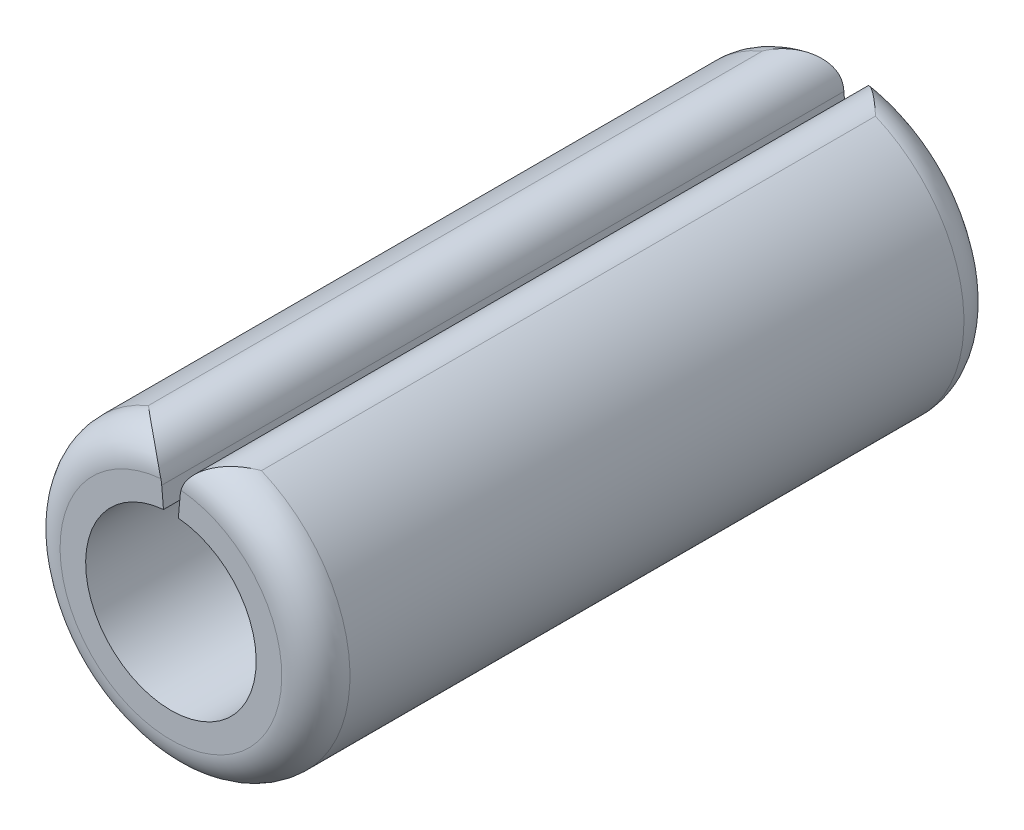
ISO-10303-21;
HEADER;
FILE_DESCRIPTION(('STEP AP214'),'2;1');
FILE_NAME('part.step','',(''),(''),'','','');
FILE_SCHEMA(('AUTOMOTIVE_DESIGN { 1 0 10303 214 1 1 1 1 }'));
ENDSEC;
DATA;
#1=APPLICATION_CONTEXT('core data for automotive mechanical design processes');
#2=APPLICATION_PROTOCOL_DEFINITION('international standard','automotive_design',2000,#1);
#3=PRODUCT_CONTEXT('',#1,'mechanical');
#4=PRODUCT('Part','Part','',(#3));
#5=PRODUCT_RELATED_PRODUCT_CATEGORY('part','',(#4));
#6=PRODUCT_DEFINITION_FORMATION('','',#4);
#7=PRODUCT_DEFINITION_CONTEXT('part definition',#1,'design');
#8=PRODUCT_DEFINITION('design','',#6,#7);
#9=PRODUCT_DEFINITION_SHAPE('','',#8);
#10=(LENGTH_UNIT() NAMED_UNIT(*) SI_UNIT(.MILLI.,.METRE.));
#11=(NAMED_UNIT(*) PLANE_ANGLE_UNIT() SI_UNIT($,.RADIAN.));
#12=(NAMED_UNIT(*) SI_UNIT($,.STERADIAN.) SOLID_ANGLE_UNIT());
#13=UNCERTAINTY_MEASURE_WITH_UNIT(LENGTH_MEASURE(1.E-05),#10,'distance_accuracy_value','');
#14=(GEOMETRIC_REPRESENTATION_CONTEXT(3) GLOBAL_UNCERTAINTY_ASSIGNED_CONTEXT((#13)) GLOBAL_UNIT_ASSIGNED_CONTEXT((#10,
#11,#12)) REPRESENTATION_CONTEXT('',''));
#15=CARTESIAN_POINT('',(0.,0.,0.));
#16=DIRECTION('',(0.,0.,1.));
#17=DIRECTION('',(1.,0.,0.));
#18=AXIS2_PLACEMENT_3D('',#15,#16,#17);
#19=CARTESIAN_POINT('',(0.,0.,-2.));
#20=DIRECTION('',(0.,0.,1.));
#21=DIRECTION('',(1.,0.,0.));
#22=AXIS2_PLACEMENT_3D('',#19,#20,#21);
#23=CYLINDRICAL_SURFACE('',#22,0.85);
#24=CARTESIAN_POINT('',(0.,0.,-1.8));
#25=DIRECTION('',(0.,0.,1.));
#26=DIRECTION('',(1.,0.,0.));
#27=AXIS2_PLACEMENT_3D('',#24,#25,#26);
#28=CIRCLE('',#27,0.85);
#29=CARTESIAN_POINT('',(-0.33103157101867,0.782890860202692,-1.8));
#30=VERTEX_POINT('',#29);
#31=CARTESIAN_POINT('',(0.33103157101867,0.782890860202692,-1.8));
#32=VERTEX_POINT('',#31);
#33=EDGE_CURVE('E141',#30,#32,#28,.T.);
#34=ORIENTED_EDGE('',*,*,#33,.T.);
#35=DIRECTION('',(0.,0.,1.));
#36=VECTOR('',#35,1.);
#37=CARTESIAN_POINT('',(0.33103157101867,0.782890860202692,-2.));
#38=LINE('',#37,#36);
#39=CARTESIAN_POINT('',(0.33103157101867,0.782890860202692,1.8));
#40=VERTEX_POINT('',#39);
#41=EDGE_CURVE('E146',#32,#40,#38,.T.);
#42=ORIENTED_EDGE('',*,*,#41,.T.);
#43=CARTESIAN_POINT('',(0.,0.,1.8));
#44=DIRECTION('',(0.,0.,1.));
#45=DIRECTION('',(1.,0.,0.));
#46=AXIS2_PLACEMENT_3D('',#43,#44,#45);
#47=CIRCLE('',#46,0.85);
#48=CARTESIAN_POINT('',(-0.33103157101867,0.782890860202692,1.8));
#49=VERTEX_POINT('',#48);
#50=EDGE_CURVE('E143',#40,#49,#47,.F.);
#51=ORIENTED_EDGE('',*,*,#50,.T.);
#52=DIRECTION('',(0.,0.,1.));
#53=VECTOR('',#52,1.);
#54=CARTESIAN_POINT('',(-0.33103157101867,0.782890860202692,-2.));
#55=LINE('',#54,#53);
#56=EDGE_CURVE('E139',#49,#30,#55,.F.);
#57=ORIENTED_EDGE('',*,*,#56,.T.);
#58=EDGE_LOOP('',(#34,#42,#51,#57));
#59=FACE_BOUND('',#58,.T.);
#60=ADVANCED_FACE('F31',(#59),#23,.T.);
#61=CARTESIAN_POINT('',(-0.0435778713738293,0.498097349045873,-2.));
#62=DIRECTION('',(0.996194698091746,0.0871557427476585,0.));
#63=DIRECTION('',(-0.0871557427476585,0.996194698091746,0.));
#64=AXIS2_PLACEMENT_3D('',#61,#62,#63);
#65=PLANE('',#64);
#66=DIRECTION('',(-0.0871557427476584,0.996194698091745,0.));
#67=VECTOR('',#66,1.);
#68=CARTESIAN_POINT('',(-0.0435778713738293,0.498097349045873,-2.));
#69=LINE('',#68,#67);
#70=CARTESIAN_POINT('',(-0.0435778713738293,0.498097349045873,-2.));
#71=VERTEX_POINT('',#70);
#72=CARTESIAN_POINT('',(-0.0539028499841634,0.616112394586884,-2.));
#73=VERTEX_POINT('',#72);
#74=EDGE_CURVE('E121',#71,#73,#69,.T.);
#75=ORIENTED_EDGE('',*,*,#74,.T.);
#76=DIRECTION('',(0.,0.,1.));
#77=VECTOR('',#76,1.);
#78=CARTESIAN_POINT('',(-0.0539028499841634,0.616112394586884,-2.));
#79=LINE('',#78,#77);
#80=CARTESIAN_POINT('',(-0.0539028499841634,0.616112394586884,2.));
#81=VERTEX_POINT('',#80);
#82=EDGE_CURVE('E11',#73,#81,#79,.T.);
#83=ORIENTED_EDGE('',*,*,#82,.T.);
#84=DIRECTION('',(-0.0871557427476584,0.996194698091745,0.));
#85=VECTOR('',#84,1.);
#86=CARTESIAN_POINT('',(-0.0435778713738293,0.498097349045873,2.));
#87=LINE('',#86,#85);
#88=CARTESIAN_POINT('',(-0.0435778713738293,0.498097349045873,2.));
#89=VERTEX_POINT('',#88);
#90=EDGE_CURVE('E124',#89,#81,#87,.T.);
#91=ORIENTED_EDGE('',*,*,#90,.F.);
#92=DIRECTION('',(0.,0.,1.));
#93=VECTOR('',#92,1.);
#94=CARTESIAN_POINT('',(-0.0435778713738293,0.498097349045873,-2.));
#95=LINE('',#94,#93);
#96=EDGE_CURVE('E120',#71,#89,#95,.T.);
#97=ORIENTED_EDGE('',*,*,#96,.F.);
#98=EDGE_LOOP('',(#75,#83,#91,#97));
#99=FACE_BOUND('',#98,.T.);
#100=ADVANCED_FACE('F185',(#99),#65,.T.);
#101=CARTESIAN_POINT('',(0.,0.,-2.));
#102=DIRECTION('',(0.,0.,1.));
#103=DIRECTION('',(1.,0.,0.));
#104=AXIS2_PLACEMENT_3D('',#101,#102,#103);
#105=CYLINDRICAL_SURFACE('',#104,0.5);
#106=ORIENTED_EDGE('',*,*,#96,.T.);
#107=CARTESIAN_POINT('',(0.,0.,2.));
#108=DIRECTION('',(0.,0.,-1.));
#109=DIRECTION('',(1.,0.,0.));
#110=AXIS2_PLACEMENT_3D('',#107,#108,#109);
#111=CIRCLE('',#110,0.5);
#112=CARTESIAN_POINT('',(0.0435778713738293,0.498097349045873,2.));
#113=VERTEX_POINT('',#112);
#114=EDGE_CURVE('E106',#113,#89,#111,.T.);
#115=ORIENTED_EDGE('',*,*,#114,.F.);
#116=DIRECTION('',(0.,0.,1.));
#117=VECTOR('',#116,1.);
#118=CARTESIAN_POINT('',(0.0435778713738293,0.498097349045873,-2.));
#119=LINE('',#118,#117);
#120=CARTESIAN_POINT('',(0.0435778713738293,0.498097349045873,-2.));
#121=VERTEX_POINT('',#120);
#122=EDGE_CURVE('E114',#121,#113,#119,.T.);
#123=ORIENTED_EDGE('',*,*,#122,.F.);
#124=CARTESIAN_POINT('',(0.,0.,-2.));
#125=DIRECTION('',(0.,0.,-1.));
#126=DIRECTION('',(1.,0.,0.));
#127=AXIS2_PLACEMENT_3D('',#124,#125,#126);
#128=CIRCLE('',#127,0.5);
#129=EDGE_CURVE('E129',#121,#71,#128,.T.);
#130=ORIENTED_EDGE('',*,*,#129,.T.);
#131=EDGE_LOOP('',(#106,#115,#123,#130));
#132=FACE_BOUND('',#131,.T.);
#133=ADVANCED_FACE('F123',(#132),#105,.F.);
#134=CARTESIAN_POINT('',(0.0740823813355097,0.846765493377984,-2.));
#135=DIRECTION('',(-0.996194698091746,0.0871557427476585,0.));
#136=DIRECTION('',(-0.0871557427476585,-0.996194698091746,0.));
#137=AXIS2_PLACEMENT_3D('',#134,#135,#136);
#138=PLANE('',#137);
#139=DIRECTION('',(-0.0871557427476584,-0.996194698091745,0.));
#140=VECTOR('',#139,1.);
#141=CARTESIAN_POINT('',(0.0740823813355097,0.846765493377984,2.));
#142=LINE('',#141,#140);
#143=CARTESIAN_POINT('',(0.0539028499841634,0.616112394586884,2.));
#144=VERTEX_POINT('',#143);
#145=EDGE_CURVE('E100',#144,#113,#142,.T.);
#146=ORIENTED_EDGE('',*,*,#145,.F.);
#147=DIRECTION('',(0.,0.,1.));
#148=VECTOR('',#147,1.);
#149=CARTESIAN_POINT('',(0.0539028499841634,0.616112394586884,-2.));
#150=LINE('',#149,#148);
#151=CARTESIAN_POINT('',(0.0539028499841595,0.61611239458684,-2.));
#152=VERTEX_POINT('',#151);
#153=EDGE_CURVE('E44',#144,#152,#150,.F.);
#154=ORIENTED_EDGE('',*,*,#153,.T.);
#155=DIRECTION('',(-0.0871557427476584,-0.996194698091745,0.));
#156=VECTOR('',#155,1.);
#157=CARTESIAN_POINT('',(0.0740823813355097,0.846765493377984,-2.));
#158=LINE('',#157,#156);
#159=EDGE_CURVE('E116',#152,#121,#158,.T.);
#160=ORIENTED_EDGE('',*,*,#159,.T.);
#161=ORIENTED_EDGE('',*,*,#122,.T.);
#162=EDGE_LOOP('',(#146,#154,#160,#161));
#163=FACE_BOUND('',#162,.T.);
#164=ADVANCED_FACE('F115',(#163),#138,.T.);
#165=CARTESIAN_POINT('',(0.,0.,-2.));
#166=DIRECTION('',(0.,0.,1.));
#167=DIRECTION('',(1.,0.,0.));
#168=AXIS2_PLACEMENT_3D('',#165,#166,#167);
#169=PLANE('',#168);
#170=ORIENTED_EDGE('',*,*,#159,.F.);
#171=CARTESIAN_POINT('',(0.253141789602513,0.598681246037353,-2.));
#172=DIRECTION('',(0.,0.,1.));
#173=DIRECTION('',(1.,0.,0.));
#174=AXIS2_PLACEMENT_3D('',#171,#172,#173);
#175=CIRCLE('',#174,0.2);
#176=CARTESIAN_POINT('',(0.0591421818509471,0.647303794462777,-2.));
#177=VERTEX_POINT('',#176);
#178=EDGE_CURVE('E52',#152,#177,#175,.F.);
#179=ORIENTED_EDGE('',*,*,#178,.T.);
#180=CARTESIAN_POINT('',(0.,0.,-2.));
#181=DIRECTION('',(0.,0.,1.));
#182=DIRECTION('',(1.,0.,0.));
#183=AXIS2_PLACEMENT_3D('',#180,#181,#182);
#184=CIRCLE('',#183,0.65);
#185=CARTESIAN_POINT('',(-0.0591421818509566,0.64730379446288,-2.));
#186=VERTEX_POINT('',#185);
#187=EDGE_CURVE('E56',#177,#186,#184,.F.);
#188=ORIENTED_EDGE('',*,*,#187,.T.);
#189=CARTESIAN_POINT('',(-0.253141789602513,0.598681246037353,-2.));
#190=DIRECTION('',(0.,0.,1.));
#191=DIRECTION('',(1.,0.,0.));
#192=AXIS2_PLACEMENT_3D('',#189,#190,#191);
#193=CIRCLE('',#192,0.2);
#194=EDGE_CURVE('E148',#186,#73,#193,.F.);
#195=ORIENTED_EDGE('',*,*,#194,.T.);
#196=ORIENTED_EDGE('',*,*,#74,.F.);
#197=ORIENTED_EDGE('',*,*,#129,.F.);
#198=EDGE_LOOP('',(#170,#179,#188,#195,#196,#197));
#199=FACE_BOUND('',#198,.T.);
#200=ADVANCED_FACE('F195',(#199),#169,.F.);
#201=CARTESIAN_POINT('',(0.,0.,2.));
#202=DIRECTION('',(0.,0.,1.));
#203=DIRECTION('',(1.,0.,0.));
#204=AXIS2_PLACEMENT_3D('',#201,#202,#203);
#205=PLANE('',#204);
#206=CARTESIAN_POINT('',(0.,0.,2.));
#207=DIRECTION('',(0.,0.,1.));
#208=DIRECTION('',(1.,0.,0.));
#209=AXIS2_PLACEMENT_3D('',#206,#207,#208);
#210=CIRCLE('',#209,0.65);
#211=CARTESIAN_POINT('',(-0.0591421818509565,0.64730379446288,2.));
#212=VERTEX_POINT('',#211);
#213=CARTESIAN_POINT('',(0.0591421818509471,0.647303794462777,2.));
#214=VERTEX_POINT('',#213);
#215=EDGE_CURVE('E136',#212,#214,#210,.T.);
#216=ORIENTED_EDGE('',*,*,#215,.T.);
#217=CARTESIAN_POINT('',(0.253141789602513,0.598681246037353,2.));
#218=DIRECTION('',(0.,0.,1.));
#219=DIRECTION('',(1.,0.,0.));
#220=AXIS2_PLACEMENT_3D('',#217,#218,#219);
#221=CIRCLE('',#220,0.2);
#222=EDGE_CURVE('E109',#214,#144,#221,.T.);
#223=ORIENTED_EDGE('',*,*,#222,.T.);
#224=ORIENTED_EDGE('',*,*,#145,.T.);
#225=ORIENTED_EDGE('',*,*,#114,.T.);
#226=ORIENTED_EDGE('',*,*,#90,.T.);
#227=CARTESIAN_POINT('',(-0.253141789602513,0.598681246037353,2.));
#228=DIRECTION('',(0.,0.,1.));
#229=DIRECTION('',(1.,0.,0.));
#230=AXIS2_PLACEMENT_3D('',#227,#228,#229);
#231=CIRCLE('',#230,0.2);
#232=EDGE_CURVE('E133',#81,#212,#231,.T.);
#233=ORIENTED_EDGE('',*,*,#232,.T.);
#234=EDGE_LOOP('',(#216,#223,#224,#225,#226,#233));
#235=FACE_BOUND('',#234,.T.);
#236=ADVANCED_FACE('F103',(#235),#205,.T.);
#237=CARTESIAN_POINT('',(0.,0.,-1.8));
#238=DIRECTION('',(0.,0.,1.));
#239=DIRECTION('',(1.,0.,0.));
#240=AXIS2_PLACEMENT_3D('',#237,#238,#239);
#241=TOROIDAL_SURFACE('',#240,0.65,0.2);
#242=CARTESIAN_POINT('',(0.0591421818509565,0.64730379446288,-2.));
#243=CARTESIAN_POINT('',(0.061388203309454,0.65632378033406,-2.00000949761535));
#244=CARTESIAN_POINT('',(0.0642821264878056,0.665150616907234,-1.99936795739193));
#245=CARTESIAN_POINT('',(0.0711561601159736,0.682124523084979,-1.99696136109512));
#246=CARTESIAN_POINT('',(0.0751268703909886,0.690276713593133,-1.99520585978694));
#247=CARTESIAN_POINT('',(0.0839731351495872,0.705740159215838,-1.99075231952684));
#248=CARTESIAN_POINT('',(0.0888453930067362,0.713054325758262,-1.98805768390232));
#249=CARTESIAN_POINT('',(0.0993206186000844,0.726797781535828,-1.98189777782451));
#250=CARTESIAN_POINT('',(0.104925300945739,0.733224919278835,-1.97843068518377));
#251=CARTESIAN_POINT('',(0.118926243242915,0.747408231362618,-1.96944719539802));
#252=CARTESIAN_POINT('',(0.127573765522741,0.754740825723924,-1.96365279893225));
#253=CARTESIAN_POINT('',(0.145548546275197,0.767638318869548,-1.95122270107133));
#254=CARTESIAN_POINT('',(0.15487673942232,0.77320072852736,-1.94458583321513));
#255=CARTESIAN_POINT('',(0.176547818756811,0.783929490622952,-1.92879639465275));
#256=CARTESIAN_POINT('',(0.189014289366035,0.788566251220387,-1.91945392499201));
#257=CARTESIAN_POINT('',(0.21413434350373,0.795271574379614,-1.90012744672511));
#258=CARTESIAN_POINT('',(0.226788113583198,0.797337373806659,-1.89014275999292));
#259=CARTESIAN_POINT('',(0.252112010395145,0.799086742497661,-1.8696237401965));
#260=CARTESIAN_POINT('',(0.264779635264727,0.798734791998183,-1.85908347920546));
#261=CARTESIAN_POINT('',(0.28961665464385,0.795723617851454,-1.83779272479833));
#262=CARTESIAN_POINT('',(0.301786913002742,0.793068589656264,-1.82704264838573));
#263=CARTESIAN_POINT('',(0.31871887209796,0.787701935811779,-1.81155648514762));
#264=CARTESIAN_POINT('',(0.323792760001955,0.785864334197671,-1.80684315909966));
#265=CARTESIAN_POINT('',(0.329534590120965,0.783518465952335,-1.80141945754837));
#266=CARTESIAN_POINT('',(0.330284042489713,0.783206936330928,-1.80070972823868));
#267=CARTESIAN_POINT('',(0.33103157101867,0.782890860202692,-1.8));
#268=B_SPLINE_CURVE_WITH_KNOTS('',3,(#242,#243,#244,#245,#246,#247,#248,#249,#250,#251,#252,
#253,#254,#255,#256,#257,#258,#259,#260,#261,#262,#263,#264,#265,#266,#267),.UNSPECIFIED.,.F.,
.F.,(4,2,2,2,2,2,2,2,2,2,2,2,4),(0.,0.0277951597696592,0.0553550768034124,0.0828161405239418,
0.11034268261349,0.148333452938316,0.186377409933963,0.234883662910508,0.283442002979502,
0.332715235531829,0.38189889647109,0.403382501982036,0.406616966098801),.UNSPECIFIED.);
#269=EDGE_CURVE('E261',#32,#177,#268,.F.);
#270=ORIENTED_EDGE('',*,*,#269,.F.);
#271=ORIENTED_EDGE('',*,*,#33,.F.);
#272=CARTESIAN_POINT('',(-0.0591421818509566,0.64730379446288,-2.));
#273=CARTESIAN_POINT('',(-0.0613882033094541,0.65632378033406,-2.00000949761535));
#274=CARTESIAN_POINT('',(-0.0642821264878057,0.665150616907234,-1.99936795739193));
#275=CARTESIAN_POINT('',(-0.0711561601159737,0.682124523084979,-1.99696136109512));
#276=CARTESIAN_POINT('',(-0.0751268703909886,0.690276713593133,-1.99520585978694));
#277=CARTESIAN_POINT('',(-0.0839731351495873,0.705740159215838,-1.99075231952684));
#278=CARTESIAN_POINT('',(-0.0888453930067363,0.713054325758262,-1.98805768390232));
#279=CARTESIAN_POINT('',(-0.0993206186000846,0.726797781535828,-1.98189777782451));
#280=CARTESIAN_POINT('',(-0.104925300945739,0.733224919278835,-1.97843068518377));
#281=CARTESIAN_POINT('',(-0.118926243242915,0.747408231362618,-1.96944719539802));
#282=CARTESIAN_POINT('',(-0.127573765522741,0.754740825723924,-1.96365279893225));
#283=CARTESIAN_POINT('',(-0.145548546275197,0.767638318869548,-1.95122270107133));
#284=CARTESIAN_POINT('',(-0.15487673942232,0.77320072852736,-1.94458583321513));
#285=CARTESIAN_POINT('',(-0.176547818756811,0.783929490622952,-1.92879639465275));
#286=CARTESIAN_POINT('',(-0.189014289366035,0.788566251220387,-1.91945392499201));
#287=CARTESIAN_POINT('',(-0.21413434350373,0.795271574379614,-1.90012744672511));
#288=CARTESIAN_POINT('',(-0.226788113583199,0.797337373806658,-1.89014275999292));
#289=CARTESIAN_POINT('',(-0.252112010395145,0.799086742497661,-1.8696237401965));
#290=CARTESIAN_POINT('',(-0.264779635264724,0.798734791998184,-1.85908347920546));
#291=CARTESIAN_POINT('',(-0.289616654643853,0.795723617851453,-1.83779272479834));
#292=CARTESIAN_POINT('',(-0.301786913002753,0.79306858965626,-1.82704264838574));
#293=CARTESIAN_POINT('',(-0.318718872097954,0.787701935811782,-1.81155648514761));
#294=CARTESIAN_POINT('',(-0.32379276000194,0.785864334197677,-1.80684315909964));
#295=CARTESIAN_POINT('',(-0.329534590120961,0.783518465952336,-1.80141945754836));
#296=CARTESIAN_POINT('',(-0.33028404248971,0.783206936330929,-1.80070972823868));
#297=CARTESIAN_POINT('',(-0.33103157101867,0.782890860202692,-1.8));
#298=B_SPLINE_CURVE_WITH_KNOTS('',3,(#272,#273,#274,#275,#276,#277,#278,#279,#280,#281,#282,
#283,#284,#285,#286,#287,#288,#289,#290,#291,#292,#293,#294,#295,#296,#297),.UNSPECIFIED.,.F.,
.F.,(4,2,2,2,2,2,2,2,2,2,2,2,4),(0.,0.0277951597696593,0.0553550768034125,0.0828161405239421,
0.11034268261349,0.148333452938316,0.186377409933963,0.234883662910508,0.283442002979502,
0.332715235531829,0.38189889647109,0.403382501982036,0.406616966098801),.UNSPECIFIED.);
#299=EDGE_CURVE('E36',#186,#30,#298,.T.);
#300=ORIENTED_EDGE('',*,*,#299,.F.);
#301=ORIENTED_EDGE('',*,*,#187,.F.);
#302=EDGE_LOOP('',(#270,#271,#300,#301));
#303=FACE_BOUND('',#302,.T.);
#304=ADVANCED_FACE('F33',(#303),#241,.T.);
#305=CARTESIAN_POINT('',(-0.253141789602513,0.598681246037353,-2.));
#306=DIRECTION('',(0.,0.,1.));
#307=DIRECTION('',(1.,0.,0.));
#308=AXIS2_PLACEMENT_3D('',#305,#306,#307);
#309=CYLINDRICAL_SURFACE('',#308,0.2);
#310=ORIENTED_EDGE('',*,*,#299,.T.);
#311=ORIENTED_EDGE('',*,*,#56,.F.);
#312=CARTESIAN_POINT('',(-0.0591421818509565,0.64730379446288,2.));
#313=CARTESIAN_POINT('',(-0.0613882033094541,0.65632378033406,2.00000949761535));
#314=CARTESIAN_POINT('',(-0.0642821264878057,0.665150616907234,1.99936795739193));
#315=CARTESIAN_POINT('',(-0.0711561601159737,0.682124523084979,1.99696136109512));
#316=CARTESIAN_POINT('',(-0.0751268703909886,0.690276713593133,1.99520585978694));
#317=CARTESIAN_POINT('',(-0.0839731351495873,0.705740159215838,1.99075231952684));
#318=CARTESIAN_POINT('',(-0.0888453930067363,0.713054325758262,1.98805768390232));
#319=CARTESIAN_POINT('',(-0.0993206186000846,0.726797781535828,1.98189777782451));
#320=CARTESIAN_POINT('',(-0.104925300945739,0.733224919278835,1.97843068518377));
#321=CARTESIAN_POINT('',(-0.118926243242915,0.747408231362618,1.96944719539802));
#322=CARTESIAN_POINT('',(-0.127573765522741,0.754740825723924,1.96365279893225));
#323=CARTESIAN_POINT('',(-0.145548546275197,0.767638318869548,1.95122270107133));
#324=CARTESIAN_POINT('',(-0.15487673942232,0.77320072852736,1.94458583321513));
#325=CARTESIAN_POINT('',(-0.176547818756811,0.783929490622952,1.92879639465275));
#326=CARTESIAN_POINT('',(-0.189014289366035,0.788566251220387,1.91945392499201));
#327=CARTESIAN_POINT('',(-0.21413434350373,0.795271574379614,1.90012744672511));
#328=CARTESIAN_POINT('',(-0.226788113583199,0.797337373806658,1.89014275999292));
#329=CARTESIAN_POINT('',(-0.252112010395144,0.799086742497661,1.8696237401965));
#330=CARTESIAN_POINT('',(-0.264779635264724,0.798734791998184,1.85908347920546));
#331=CARTESIAN_POINT('',(-0.289616654643854,0.795723617851453,1.83779272479834));
#332=CARTESIAN_POINT('',(-0.301786913002754,0.79306858965626,1.82704264838574));
#333=CARTESIAN_POINT('',(-0.318718872097953,0.787701935811782,1.81155648514761));
#334=CARTESIAN_POINT('',(-0.323792760001939,0.785864334197677,1.80684315909964));
#335=CARTESIAN_POINT('',(-0.329534590120961,0.783518465952337,1.80141945754836));
#336=CARTESIAN_POINT('',(-0.33028404248971,0.783206936330929,1.80070972823868));
#337=CARTESIAN_POINT('',(-0.33103157101867,0.782890860202692,1.8));
#338=B_SPLINE_CURVE_WITH_KNOTS('',3,(#312,#313,#314,#315,#316,#317,#318,#319,#320,#321,#322,
#323,#324,#325,#326,#327,#328,#329,#330,#331,#332,#333,#334,#335,#336,#337),.UNSPECIFIED.,.F.,
.F.,(4,2,2,2,2,2,2,2,2,2,2,2,4),(0.,0.0277951597696593,0.0553550768034125,0.082816140523942,
0.11034268261349,0.148333452938316,0.186377409933963,0.234883662910508,0.283442002979502,
0.332715235531829,0.38189889647109,0.403382501982036,0.406616966098801),.UNSPECIFIED.);
#339=EDGE_CURVE('E160',#212,#49,#338,.T.);
#340=ORIENTED_EDGE('',*,*,#339,.F.);
#341=ORIENTED_EDGE('',*,*,#232,.F.);
#342=ORIENTED_EDGE('',*,*,#82,.F.);
#343=ORIENTED_EDGE('',*,*,#194,.F.);
#344=EDGE_LOOP('',(#310,#311,#340,#341,#342,#343));
#345=FACE_BOUND('',#344,.T.);
#346=ADVANCED_FACE('F171',(#345),#309,.T.);
#347=CARTESIAN_POINT('',(0.253141789602513,0.598681246037353,-2.));
#348=DIRECTION('',(0.,0.,1.));
#349=DIRECTION('',(1.,0.,0.));
#350=AXIS2_PLACEMENT_3D('',#347,#348,#349);
#351=CYLINDRICAL_SURFACE('',#350,0.2);
#352=ORIENTED_EDGE('',*,*,#153,.F.);
#353=ORIENTED_EDGE('',*,*,#222,.F.);
#354=CARTESIAN_POINT('',(0.0591421818509565,0.64730379446288,2.));
#355=CARTESIAN_POINT('',(0.061388203309454,0.65632378033406,2.00000949761535));
#356=CARTESIAN_POINT('',(0.0642821264878056,0.665150616907234,1.99936795739193));
#357=CARTESIAN_POINT('',(0.0711561601159737,0.682124523084979,1.99696136109512));
#358=CARTESIAN_POINT('',(0.0751268703909886,0.690276713593133,1.99520585978694));
#359=CARTESIAN_POINT('',(0.0839731351495872,0.705740159215838,1.99075231952684));
#360=CARTESIAN_POINT('',(0.0888453930067362,0.713054325758262,1.98805768390232));
#361=CARTESIAN_POINT('',(0.0993206186000845,0.726797781535828,1.98189777782451));
#362=CARTESIAN_POINT('',(0.104925300945739,0.733224919278835,1.97843068518377));
#363=CARTESIAN_POINT('',(0.118926243242915,0.747408231362618,1.96944719539802));
#364=CARTESIAN_POINT('',(0.127573765522741,0.754740825723924,1.96365279893225));
#365=CARTESIAN_POINT('',(0.145548546275197,0.767638318869548,1.95122270107133));
#366=CARTESIAN_POINT('',(0.15487673942232,0.77320072852736,1.94458583321513));
#367=CARTESIAN_POINT('',(0.176547818756811,0.783929490622952,1.92879639465275));
#368=CARTESIAN_POINT('',(0.189014289366035,0.788566251220387,1.91945392499201));
#369=CARTESIAN_POINT('',(0.21413434350373,0.795271574379614,1.90012744672511));
#370=CARTESIAN_POINT('',(0.226788113583198,0.797337373806658,1.89014275999292));
#371=CARTESIAN_POINT('',(0.252112010395144,0.799086742497661,1.8696237401965));
#372=CARTESIAN_POINT('',(0.264779635264725,0.798734791998184,1.85908347920546));
#373=CARTESIAN_POINT('',(0.289616654643852,0.795723617851453,1.83779272479833));
#374=CARTESIAN_POINT('',(0.30178691300275,0.793068589656261,1.82704264838574));
#375=CARTESIAN_POINT('',(0.318718872097955,0.787701935811781,1.81155648514762));
#376=CARTESIAN_POINT('',(0.323792760001944,0.785864334197676,1.80684315909964));
#377=CARTESIAN_POINT('',(0.329534590120962,0.783518465952336,1.80141945754837));
#378=CARTESIAN_POINT('',(0.330284042489711,0.783206936330928,1.80070972823868));
#379=CARTESIAN_POINT('',(0.33103157101867,0.782890860202692,1.8));
#380=B_SPLINE_CURVE_WITH_KNOTS('',3,(#354,#355,#356,#357,#358,#359,#360,#361,#362,#363,#364,
#365,#366,#367,#368,#369,#370,#371,#372,#373,#374,#375,#376,#377,#378,#379),.UNSPECIFIED.,.F.,
.F.,(4,2,2,2,2,2,2,2,2,2,2,2,4),(0.,0.0277951597696593,0.0553550768034125,0.082816140523942,
0.11034268261349,0.148333452938316,0.186377409933963,0.234883662910508,0.283442002979502,
0.332715235531829,0.38189889647109,0.403382501982036,0.406616966098801),.UNSPECIFIED.);
#381=EDGE_CURVE('E153',#40,#214,#380,.F.);
#382=ORIENTED_EDGE('',*,*,#381,.F.);
#383=ORIENTED_EDGE('',*,*,#41,.F.);
#384=ORIENTED_EDGE('',*,*,#269,.T.);
#385=ORIENTED_EDGE('',*,*,#178,.F.);
#386=EDGE_LOOP('',(#352,#353,#382,#383,#384,#385));
#387=FACE_BOUND('',#386,.T.);
#388=ADVANCED_FACE('F164',(#387),#351,.T.);
#389=CARTESIAN_POINT('',(0.,0.,1.8));
#390=DIRECTION('',(0.,0.,1.));
#391=DIRECTION('',(1.,0.,0.));
#392=AXIS2_PLACEMENT_3D('',#389,#390,#391);
#393=TOROIDAL_SURFACE('',#392,0.65,0.2);
#394=ORIENTED_EDGE('',*,*,#339,.T.);
#395=ORIENTED_EDGE('',*,*,#50,.F.);
#396=ORIENTED_EDGE('',*,*,#381,.T.);
#397=ORIENTED_EDGE('',*,*,#215,.F.);
#398=EDGE_LOOP('',(#394,#395,#396,#397));
#399=FACE_BOUND('',#398,.T.);
#400=ADVANCED_FACE('F167',(#399),#393,.T.);
#401=CLOSED_SHELL('',(#60,#100,#133,#164,#200,#236,#304,#346,#388,#400));
#402=MANIFOLD_SOLID_BREP('B2',#401);
#403=ADVANCED_BREP_SHAPE_REPRESENTATION('',(#18,#402),#14);
#404=SHAPE_DEFINITION_REPRESENTATION(#9,#403);
ENDSEC;
END-ISO-10303-21;
